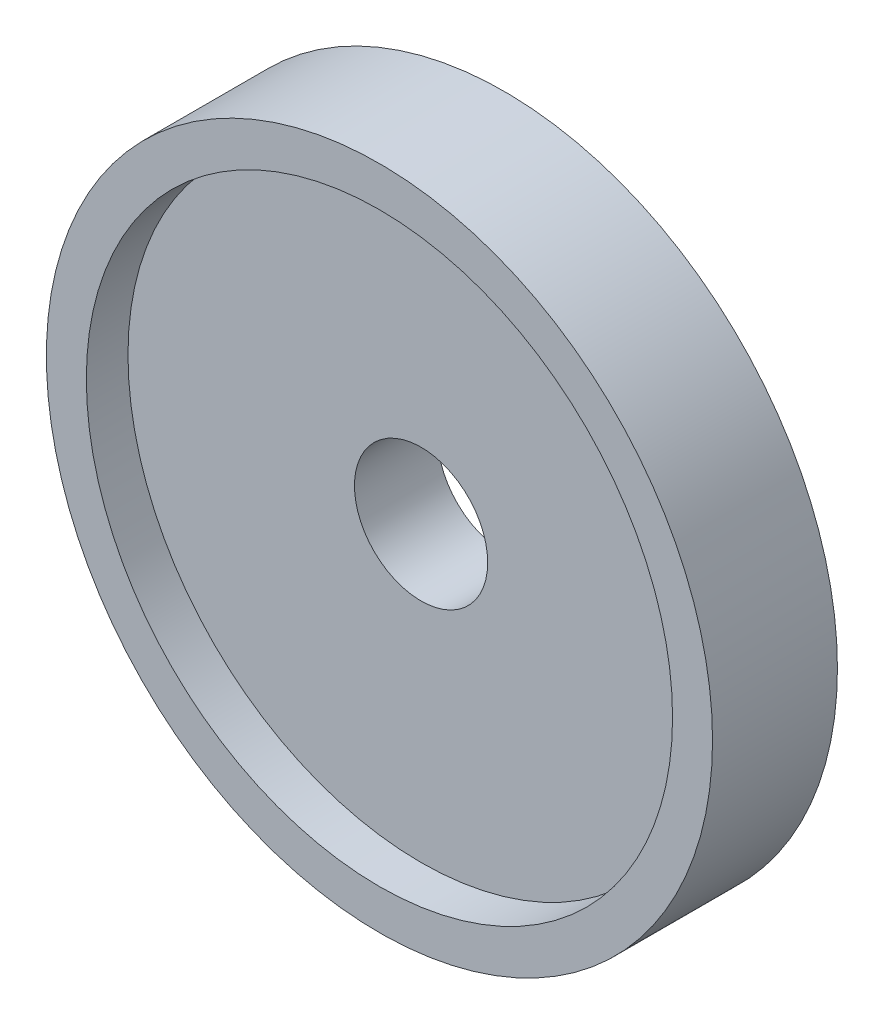
ISO-10303-21;
HEADER;
FILE_DESCRIPTION(('STEP AP214'),'2;1');
FILE_NAME('part.step','',(''),(''),'','','');
FILE_SCHEMA(('AUTOMOTIVE_DESIGN { 1 0 10303 214 1 1 1 1 }'));
ENDSEC;
DATA;
#1=APPLICATION_CONTEXT('core data for automotive mechanical design processes');
#2=APPLICATION_PROTOCOL_DEFINITION('international standard','automotive_design',2000,#1);
#3=PRODUCT_CONTEXT('',#1,'mechanical');
#4=PRODUCT('Part','Part','',(#3));
#5=PRODUCT_RELATED_PRODUCT_CATEGORY('part','',(#4));
#6=PRODUCT_DEFINITION_FORMATION('','',#4);
#7=PRODUCT_DEFINITION_CONTEXT('part definition',#1,'design');
#8=PRODUCT_DEFINITION('design','',#6,#7);
#9=PRODUCT_DEFINITION_SHAPE('','',#8);
#10=(LENGTH_UNIT() NAMED_UNIT(*) SI_UNIT(.MILLI.,.METRE.));
#11=(NAMED_UNIT(*) PLANE_ANGLE_UNIT() SI_UNIT($,.RADIAN.));
#12=(NAMED_UNIT(*) SI_UNIT($,.STERADIAN.) SOLID_ANGLE_UNIT());
#13=UNCERTAINTY_MEASURE_WITH_UNIT(LENGTH_MEASURE(1.E-05),#10,'distance_accuracy_value','');
#14=(GEOMETRIC_REPRESENTATION_CONTEXT(3) GLOBAL_UNCERTAINTY_ASSIGNED_CONTEXT((#13)) GLOBAL_UNIT_ASSIGNED_CONTEXT((#10,
#11,#12)) REPRESENTATION_CONTEXT('',''));
#15=CARTESIAN_POINT('',(0.,0.,0.));
#16=DIRECTION('',(0.,0.,1.));
#17=DIRECTION('',(1.,0.,0.));
#18=AXIS2_PLACEMENT_3D('',#15,#16,#17);
#19=CARTESIAN_POINT('',(0.,0.,0.75));
#20=DIRECTION('',(0.,0.,-1.));
#21=DIRECTION('',(-1.,0.,0.));
#22=AXIS2_PLACEMENT_3D('',#19,#20,#21);
#23=CYLINDRICAL_SURFACE('',#22,2.);
#24=CARTESIAN_POINT('',(0.,0.,0.75));
#25=DIRECTION('',(0.,0.,1.));
#26=DIRECTION('',(1.,0.,0.));
#27=AXIS2_PLACEMENT_3D('',#24,#25,#26);
#28=CIRCLE('',#27,2.);
#29=CARTESIAN_POINT('',(2.,0.,0.75));
#30=VERTEX_POINT('',#29);
#31=EDGE_CURVE('E10',#30,#30,#28,.T.);
#32=ORIENTED_EDGE('',*,*,#31,.F.);
#33=EDGE_LOOP('',(#32));
#34=FACE_BOUND('',#33,.T.);
#35=CARTESIAN_POINT('',(0.,0.,0.));
#36=DIRECTION('',(0.,0.,1.));
#37=DIRECTION('',(1.,0.,0.));
#38=AXIS2_PLACEMENT_3D('',#35,#36,#37);
#39=CIRCLE('',#38,2.);
#40=CARTESIAN_POINT('',(2.,0.,0.));
#41=VERTEX_POINT('',#40);
#42=EDGE_CURVE('E38',#41,#41,#39,.T.);
#43=ORIENTED_EDGE('',*,*,#42,.T.);
#44=EDGE_LOOP('',(#43));
#45=FACE_BOUND('',#44,.T.);
#46=ADVANCED_FACE('F35',(#34,#45),#23,.T.);
#47=CARTESIAN_POINT('',(0.,0.,0.75));
#48=DIRECTION('',(0.,0.,1.));
#49=DIRECTION('',(1.,0.,0.));
#50=AXIS2_PLACEMENT_3D('',#47,#48,#49);
#51=PLANE('',#50);
#52=CARTESIAN_POINT('',(0.,0.,0.75));
#53=DIRECTION('',(0.,0.,1.));
#54=DIRECTION('',(1.,0.,0.));
#55=AXIS2_PLACEMENT_3D('',#52,#53,#54);
#56=CIRCLE('',#55,1.76);
#57=CARTESIAN_POINT('',(1.76,0.,0.75));
#58=VERTEX_POINT('',#57);
#59=EDGE_CURVE('E47',#58,#58,#56,.T.);
#60=ORIENTED_EDGE('',*,*,#59,.F.);
#61=EDGE_LOOP('',(#60));
#62=FACE_BOUND('',#61,.T.);
#63=ORIENTED_EDGE('',*,*,#31,.T.);
#64=EDGE_LOOP('',(#63));
#65=FACE_BOUND('',#64,.T.);
#66=ADVANCED_FACE('F80',(#62,#65),#51,.T.);
#67=CARTESIAN_POINT('',(0.,0.,0.));
#68=DIRECTION('',(0.,0.,1.));
#69=DIRECTION('',(1.,0.,0.));
#70=AXIS2_PLACEMENT_3D('',#67,#68,#69);
#71=PLANE('',#70);
#72=CARTESIAN_POINT('',(0.,0.,0.));
#73=DIRECTION('',(0.,0.,1.));
#74=DIRECTION('',(1.,0.,0.));
#75=AXIS2_PLACEMENT_3D('',#72,#73,#74);
#76=CIRCLE('',#75,0.4);
#77=CARTESIAN_POINT('',(0.4,0.,0.));
#78=VERTEX_POINT('',#77);
#79=EDGE_CURVE('E50',#78,#78,#76,.T.);
#80=ORIENTED_EDGE('',*,*,#79,.T.);
#81=EDGE_LOOP('',(#80));
#82=FACE_BOUND('',#81,.T.);
#83=ORIENTED_EDGE('',*,*,#42,.F.);
#84=EDGE_LOOP('',(#83));
#85=FACE_BOUND('',#84,.T.);
#86=ADVANCED_FACE('F59',(#82,#85),#71,.F.);
#87=CARTESIAN_POINT('',(0.,0.,0.5));
#88=DIRECTION('',(0.,0.,1.));
#89=DIRECTION('',(1.,0.,0.));
#90=AXIS2_PLACEMENT_3D('',#87,#88,#89);
#91=CYLINDRICAL_SURFACE('',#90,1.76);
#92=CARTESIAN_POINT('',(0.,0.,0.5));
#93=DIRECTION('',(0.,0.,1.));
#94=DIRECTION('',(1.,0.,0.));
#95=AXIS2_PLACEMENT_3D('',#92,#93,#94);
#96=CIRCLE('',#95,1.76);
#97=CARTESIAN_POINT('',(1.76,0.,0.5));
#98=VERTEX_POINT('',#97);
#99=EDGE_CURVE('E45',#98,#98,#96,.T.);
#100=ORIENTED_EDGE('',*,*,#99,.F.);
#101=EDGE_LOOP('',(#100));
#102=FACE_BOUND('',#101,.T.);
#103=ORIENTED_EDGE('',*,*,#59,.T.);
#104=EDGE_LOOP('',(#103));
#105=FACE_BOUND('',#104,.T.);
#106=ADVANCED_FACE('F71',(#102,#105),#91,.F.);
#107=CARTESIAN_POINT('',(0.,0.,0.5));
#108=DIRECTION('',(0.,0.,1.));
#109=DIRECTION('',(1.,0.,0.));
#110=AXIS2_PLACEMENT_3D('',#107,#108,#109);
#111=PLANE('',#110);
#112=CARTESIAN_POINT('',(0.,0.,0.5));
#113=DIRECTION('',(0.,0.,1.));
#114=DIRECTION('',(1.,0.,0.));
#115=AXIS2_PLACEMENT_3D('',#112,#113,#114);
#116=CIRCLE('',#115,0.4);
#117=CARTESIAN_POINT('',(0.4,0.,0.5));
#118=VERTEX_POINT('',#117);
#119=EDGE_CURVE('E53',#118,#118,#116,.T.);
#120=ORIENTED_EDGE('',*,*,#119,.F.);
#121=EDGE_LOOP('',(#120));
#122=FACE_BOUND('',#121,.T.);
#123=ORIENTED_EDGE('',*,*,#99,.T.);
#124=EDGE_LOOP('',(#123));
#125=FACE_BOUND('',#124,.T.);
#126=ADVANCED_FACE('F65',(#122,#125),#111,.T.);
#127=CARTESIAN_POINT('',(0.,0.,0.));
#128=DIRECTION('',(0.,0.,1.));
#129=DIRECTION('',(1.,0.,0.));
#130=AXIS2_PLACEMENT_3D('',#127,#128,#129);
#131=CYLINDRICAL_SURFACE('',#130,0.4);
#132=ORIENTED_EDGE('',*,*,#79,.F.);
#133=EDGE_LOOP('',(#132));
#134=FACE_BOUND('',#133,.T.);
#135=ORIENTED_EDGE('',*,*,#119,.T.);
#136=EDGE_LOOP('',(#135));
#137=FACE_BOUND('',#136,.T.);
#138=ADVANCED_FACE('F62',(#134,#137),#131,.F.);
#139=CLOSED_SHELL('',(#46,#66,#86,#106,#126,#138));
#140=MANIFOLD_SOLID_BREP('B2',#139);
#141=ADVANCED_BREP_SHAPE_REPRESENTATION('',(#18,#140),#14);
#142=SHAPE_DEFINITION_REPRESENTATION(#9,#141);
ENDSEC;
END-ISO-10303-21;
